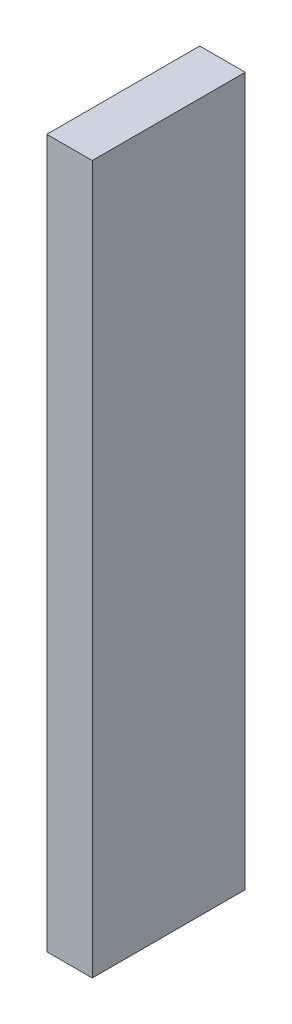
ISO-10303-21;
HEADER;
FILE_DESCRIPTION(('STEP AP214'),'2;1');
FILE_NAME('part.step','',(''),(''),'','','');
FILE_SCHEMA(('AUTOMOTIVE_DESIGN { 1 0 10303 214 1 1 1 1 }'));
ENDSEC;
DATA;
#1=APPLICATION_CONTEXT('core data for automotive mechanical design processes');
#2=APPLICATION_PROTOCOL_DEFINITION('international standard','automotive_design',2000,#1);
#3=PRODUCT_CONTEXT('',#1,'mechanical');
#4=PRODUCT('Part','Part','',(#3));
#5=PRODUCT_RELATED_PRODUCT_CATEGORY('part','',(#4));
#6=PRODUCT_DEFINITION_FORMATION('','',#4);
#7=PRODUCT_DEFINITION_CONTEXT('part definition',#1,'design');
#8=PRODUCT_DEFINITION('design','',#6,#7);
#9=PRODUCT_DEFINITION_SHAPE('','',#8);
#10=(LENGTH_UNIT() NAMED_UNIT(*) SI_UNIT(.MILLI.,.METRE.));
#11=(NAMED_UNIT(*) PLANE_ANGLE_UNIT() SI_UNIT($,.RADIAN.));
#12=(NAMED_UNIT(*) SI_UNIT($,.STERADIAN.) SOLID_ANGLE_UNIT());
#13=UNCERTAINTY_MEASURE_WITH_UNIT(LENGTH_MEASURE(1.E-05),#10,'distance_accuracy_value','');
#14=(GEOMETRIC_REPRESENTATION_CONTEXT(3) GLOBAL_UNCERTAINTY_ASSIGNED_CONTEXT((#13)) GLOBAL_UNIT_ASSIGNED_CONTEXT((#10,
#11,#12)) REPRESENTATION_CONTEXT('',''));
#15=CARTESIAN_POINT('',(0.,0.,0.));
#16=DIRECTION('',(0.,0.,1.));
#17=DIRECTION('',(1.,0.,0.));
#18=AXIS2_PLACEMENT_3D('',#15,#16,#17);
#19=CARTESIAN_POINT('',(130.275545161706,22.4180708263693,116.072028202897));
#20=DIRECTION('',(-1.69244514382854E-09,0.,1.));
#21=DIRECTION('',(1.,0.,1.69244514382854E-09));
#22=AXIS2_PLACEMENT_3D('',#19,#20,#21);
#23=PLANE('',#22);
#24=DIRECTION('',(0.,-1.,0.));
#25=VECTOR('',#24,1.);
#26=CARTESIAN_POINT('',(131.258630258719,22.4180708263693,116.072028204561));
#27=LINE('',#26,#25);
#28=CARTESIAN_POINT('',(131.258630258719,22.4180708263693,116.072028204561));
#29=VERTEX_POINT('',#28);
#30=CARTESIAN_POINT('',(131.258630258719,7.11212965552235,116.072028204561));
#31=VERTEX_POINT('',#30);
#32=EDGE_CURVE('E79',#29,#31,#27,.T.);
#33=ORIENTED_EDGE('',*,*,#32,.F.);
#34=DIRECTION('',(1.,0.,1.69244514382854E-09));
#35=VECTOR('',#34,1.);
#36=CARTESIAN_POINT('',(130.275545161706,22.4180708263693,116.072028202897));
#37=LINE('',#36,#35);
#38=CARTESIAN_POINT('',(130.275545161706,22.4180708263693,116.072028202897));
#39=VERTEX_POINT('',#38);
#40=EDGE_CURVE('E32',#39,#29,#37,.T.);
#41=ORIENTED_EDGE('',*,*,#40,.F.);
#42=DIRECTION('',(0.,-1.,0.));
#43=VECTOR('',#42,1.);
#44=CARTESIAN_POINT('',(130.275545161706,22.4180708263693,116.072028202897));
#45=LINE('',#44,#43);
#46=CARTESIAN_POINT('',(130.275545161706,7.11212965552235,116.072028202897));
#47=VERTEX_POINT('',#46);
#48=EDGE_CURVE('E71',#39,#47,#45,.T.);
#49=ORIENTED_EDGE('',*,*,#48,.T.);
#50=DIRECTION('',(1.,0.,1.69244514382854E-09));
#51=VECTOR('',#50,1.);
#52=CARTESIAN_POINT('',(130.275545161706,7.11212965552235,116.072028202897));
#53=LINE('',#52,#51);
#54=EDGE_CURVE('E10',#47,#31,#53,.T.);
#55=ORIENTED_EDGE('',*,*,#54,.T.);
#56=EDGE_LOOP('',(#33,#41,#49,#55));
#57=FACE_BOUND('',#56,.T.);
#58=ADVANCED_FACE('F16',(#57),#23,.T.);
#59=CARTESIAN_POINT('',(130.275545161706,7.11212965552235,116.072028202897));
#60=DIRECTION('',(0.,-1.,0.));
#61=DIRECTION('',(0.,0.,-1.));
#62=AXIS2_PLACEMENT_3D('',#59,#60,#61);
#63=PLANE('',#62);
#64=DIRECTION('',(1.69244514382854E-09,0.,-1.));
#65=VECTOR('',#64,1.);
#66=CARTESIAN_POINT('',(131.258630258719,7.11212965552235,116.072028204561));
#67=LINE('',#66,#65);
#68=CARTESIAN_POINT('',(131.258630264314,7.11212965552235,112.766087033712));
#69=VERTEX_POINT('',#68);
#70=EDGE_CURVE('E82',#31,#69,#67,.T.);
#71=ORIENTED_EDGE('',*,*,#70,.F.);
#72=ORIENTED_EDGE('',*,*,#54,.F.);
#73=DIRECTION('',(1.69244514382854E-09,0.,-1.));
#74=VECTOR('',#73,1.);
#75=CARTESIAN_POINT('',(130.275545161706,7.11212965552235,116.072028202897));
#76=LINE('',#75,#74);
#77=CARTESIAN_POINT('',(130.275545167301,7.11212965552235,112.766087032048));
#78=VERTEX_POINT('',#77);
#79=EDGE_CURVE('E67',#47,#78,#76,.T.);
#80=ORIENTED_EDGE('',*,*,#79,.T.);
#81=DIRECTION('',(1.,0.,1.69244514382854E-09));
#82=VECTOR('',#81,1.);
#83=CARTESIAN_POINT('',(130.275545167301,7.11212965552235,112.766087032048));
#84=LINE('',#83,#82);
#85=EDGE_CURVE('E24',#78,#69,#84,.T.);
#86=ORIENTED_EDGE('',*,*,#85,.T.);
#87=EDGE_LOOP('',(#71,#72,#80,#86));
#88=FACE_BOUND('',#87,.T.);
#89=ADVANCED_FACE('F68',(#88),#63,.T.);
#90=CARTESIAN_POINT('',(130.275545167301,7.11212965552235,112.766087032048));
#91=DIRECTION('',(1.69244514382854E-09,0.,-1.));
#92=DIRECTION('',(-1.,0.,-1.69244514382854E-09));
#93=AXIS2_PLACEMENT_3D('',#90,#91,#92);
#94=PLANE('',#93);
#95=DIRECTION('',(0.,1.,0.));
#96=VECTOR('',#95,1.);
#97=CARTESIAN_POINT('',(131.258630264314,7.11212965552235,112.766087033712));
#98=LINE('',#97,#96);
#99=CARTESIAN_POINT('',(131.258630264314,22.418070826371,112.766087025251));
#100=VERTEX_POINT('',#99);
#101=EDGE_CURVE('E65',#69,#100,#98,.T.);
#102=ORIENTED_EDGE('',*,*,#101,.F.);
#103=ORIENTED_EDGE('',*,*,#85,.F.);
#104=DIRECTION('',(0.,1.,0.));
#105=VECTOR('',#104,1.);
#106=CARTESIAN_POINT('',(130.275545167301,7.11212965552235,112.766087032048));
#107=LINE('',#106,#105);
#108=CARTESIAN_POINT('',(130.275545167301,22.418070826371,112.766087023588));
#109=VERTEX_POINT('',#108);
#110=EDGE_CURVE('E62',#78,#109,#107,.T.);
#111=ORIENTED_EDGE('',*,*,#110,.T.);
#112=DIRECTION('',(1.,0.,1.69244514382854E-09));
#113=VECTOR('',#112,1.);
#114=CARTESIAN_POINT('',(130.275545167301,22.418070826371,112.766087023588));
#115=LINE('',#114,#113);
#116=EDGE_CURVE('E48',#109,#100,#115,.T.);
#117=ORIENTED_EDGE('',*,*,#116,.T.);
#118=EDGE_LOOP('',(#102,#103,#111,#117));
#119=FACE_BOUND('',#118,.T.);
#120=ADVANCED_FACE('F60',(#119),#94,.T.);
#121=CARTESIAN_POINT('',(130.275545167301,22.418070826371,112.766087023588));
#122=DIRECTION('',(0.,1.,0.));
#123=DIRECTION('',(-1.,0.,0.));
#124=AXIS2_PLACEMENT_3D('',#121,#122,#123);
#125=PLANE('',#124);
#126=DIRECTION('',(-1.69244514382854E-09,0.,1.));
#127=VECTOR('',#126,1.);
#128=CARTESIAN_POINT('',(131.258630264314,22.418070826371,112.766087025251));
#129=LINE('',#128,#127);
#130=EDGE_CURVE('E85',#100,#29,#129,.T.);
#131=ORIENTED_EDGE('',*,*,#130,.F.);
#132=ORIENTED_EDGE('',*,*,#116,.F.);
#133=DIRECTION('',(-1.69244514382854E-09,0.,1.));
#134=VECTOR('',#133,1.);
#135=CARTESIAN_POINT('',(130.275545167301,22.418070826371,112.766087023588));
#136=LINE('',#135,#134);
#137=EDGE_CURVE('E74',#109,#39,#136,.T.);
#138=ORIENTED_EDGE('',*,*,#137,.T.);
#139=ORIENTED_EDGE('',*,*,#40,.T.);
#140=EDGE_LOOP('',(#131,#132,#138,#139));
#141=FACE_BOUND('',#140,.T.);
#142=ADVANCED_FACE('F96',(#141),#125,.T.);
#143=CARTESIAN_POINT('',(130.275545201028,17.2651002409467,92.8378644340291));
#144=DIRECTION('',(1.,0.,1.69244514382854E-09));
#145=DIRECTION('',(0.,1.,0.));
#146=AXIS2_PLACEMENT_3D('',#143,#144,#145);
#147=PLANE('',#146);
#148=ORIENTED_EDGE('',*,*,#48,.F.);
#149=ORIENTED_EDGE('',*,*,#137,.F.);
#150=ORIENTED_EDGE('',*,*,#110,.F.);
#151=ORIENTED_EDGE('',*,*,#79,.F.);
#152=EDGE_LOOP('',(#148,#149,#150,#151));
#153=FACE_BOUND('',#152,.T.);
#154=ADVANCED_FACE('F73',(#153),#147,.F.);
#155=CARTESIAN_POINT('',(131.258630298041,17.2651002409467,92.8378644356929));
#156=DIRECTION('',(1.,0.,1.69244514382854E-09));
#157=DIRECTION('',(0.,1.,0.));
#158=AXIS2_PLACEMENT_3D('',#155,#156,#157);
#159=PLANE('',#158);
#160=ORIENTED_EDGE('',*,*,#32,.T.);
#161=ORIENTED_EDGE('',*,*,#70,.T.);
#162=ORIENTED_EDGE('',*,*,#101,.T.);
#163=ORIENTED_EDGE('',*,*,#130,.T.);
#164=EDGE_LOOP('',(#160,#161,#162,#163));
#165=FACE_BOUND('',#164,.T.);
#166=ADVANCED_FACE('F89',(#165),#159,.T.);
#167=CLOSED_SHELL('',(#58,#89,#120,#142,#154,#166));
#168=MANIFOLD_SOLID_BREP('B1',#167);
#169=ADVANCED_BREP_SHAPE_REPRESENTATION('',(#18,#168),#14);
#170=SHAPE_DEFINITION_REPRESENTATION(#9,#169);
ENDSEC;
END-ISO-10303-21;
